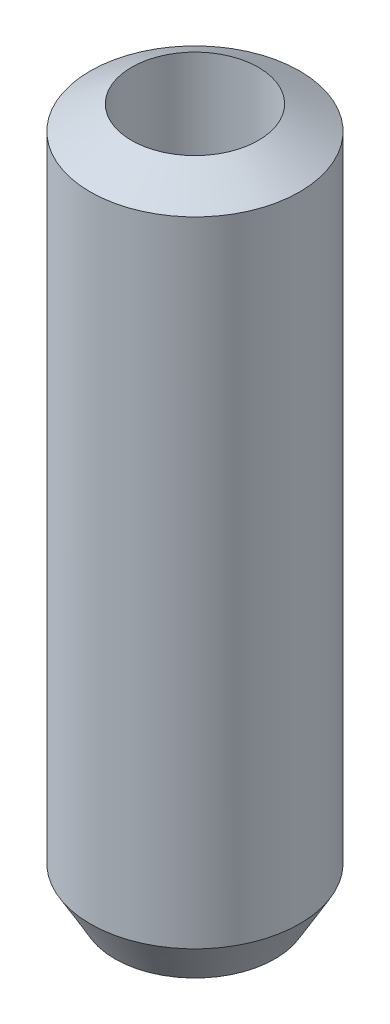
ISO-10303-21;
HEADER;
FILE_DESCRIPTION(('STEP AP214'),'2;1');
FILE_NAME('part.step','',(''),(''),'','','');
FILE_SCHEMA(('AUTOMOTIVE_DESIGN { 1 0 10303 214 1 1 1 1 }'));
ENDSEC;
DATA;
#1=APPLICATION_CONTEXT('core data for automotive mechanical design processes');
#2=APPLICATION_PROTOCOL_DEFINITION('international standard','automotive_design',2000,#1);
#3=PRODUCT_CONTEXT('',#1,'mechanical');
#4=PRODUCT('Part','Part','',(#3));
#5=PRODUCT_RELATED_PRODUCT_CATEGORY('part','',(#4));
#6=PRODUCT_DEFINITION_FORMATION('','',#4);
#7=PRODUCT_DEFINITION_CONTEXT('part definition',#1,'design');
#8=PRODUCT_DEFINITION('design','',#6,#7);
#9=PRODUCT_DEFINITION_SHAPE('','',#8);
#10=(LENGTH_UNIT() NAMED_UNIT(*) SI_UNIT(.MILLI.,.METRE.));
#11=(NAMED_UNIT(*) PLANE_ANGLE_UNIT() SI_UNIT($,.RADIAN.));
#12=(NAMED_UNIT(*) SI_UNIT($,.STERADIAN.) SOLID_ANGLE_UNIT());
#13=UNCERTAINTY_MEASURE_WITH_UNIT(LENGTH_MEASURE(1.E-05),#10,'distance_accuracy_value','');
#14=(GEOMETRIC_REPRESENTATION_CONTEXT(3) GLOBAL_UNCERTAINTY_ASSIGNED_CONTEXT((#13)) GLOBAL_UNIT_ASSIGNED_CONTEXT((#10,
#11,#12)) REPRESENTATION_CONTEXT('',''));
#15=CARTESIAN_POINT('',(0.,0.,0.));
#16=DIRECTION('',(0.,0.,1.));
#17=DIRECTION('',(1.,0.,0.));
#18=AXIS2_PLACEMENT_3D('',#15,#16,#17);
#19=CARTESIAN_POINT('',(0.,167.350945841234,0.));
#20=DIRECTION('',(0.,-1.,0.));
#21=DIRECTION('',(0.,0.,-1.));
#22=AXIS2_PLACEMENT_3D('',#19,#20,#21);
#23=CYLINDRICAL_SURFACE('',#22,25.);
#24=CARTESIAN_POINT('',(0.,161.472744934096,0.));
#25=DIRECTION('',(0.,1.,0.));
#26=DIRECTION('',(0.,0.,1.));
#27=AXIS2_PLACEMENT_3D('',#24,#25,#26);
#28=CIRCLE('',#27,25.);
#29=CARTESIAN_POINT('',(0.,161.472744934096,25.));
#30=VERTEX_POINT('',#29);
#31=EDGE_CURVE('E50',#30,#30,#28,.F.);
#32=ORIENTED_EDGE('',*,*,#31,.T.);
#33=EDGE_LOOP('',(#32));
#34=FACE_BOUND('',#33,.T.);
#35=CARTESIAN_POINT('',(0.,10.1813426282592,0.));
#36=DIRECTION('',(0.,1.,0.));
#37=DIRECTION('',(0.,0.,1.));
#38=AXIS2_PLACEMENT_3D('',#35,#36,#37);
#39=CIRCLE('',#38,25.);
#40=CARTESIAN_POINT('',(0.,10.1813426282592,25.));
#41=VERTEX_POINT('',#40);
#42=EDGE_CURVE('E51',#41,#41,#39,.T.);
#43=ORIENTED_EDGE('',*,*,#42,.T.);
#44=EDGE_LOOP('',(#43));
#45=FACE_BOUND('',#44,.T.);
#46=ADVANCED_FACE('F39',(#34,#45),#23,.T.);
#47=CARTESIAN_POINT('',(0.,0.,0.));
#48=DIRECTION('',(0.,1.,0.));
#49=DIRECTION('',(0.,0.,1.));
#50=AXIS2_PLACEMENT_3D('',#47,#48,#49);
#51=PLANE('',#50);
#52=CARTESIAN_POINT('',(0.,0.,0.));
#53=DIRECTION('',(0.,1.,0.));
#54=DIRECTION('',(0.,0.,1.));
#55=AXIS2_PLACEMENT_3D('',#52,#53,#54);
#56=CIRCLE('',#55,19.1217990928627);
#57=CARTESIAN_POINT('',(0.,0.,19.1217990928627));
#58=VERTEX_POINT('',#57);
#59=EDGE_CURVE('E10',#58,#58,#56,.F.);
#60=ORIENTED_EDGE('',*,*,#59,.T.);
#61=EDGE_LOOP('',(#60));
#62=FACE_BOUND('',#61,.T.);
#63=CARTESIAN_POINT('',(0.,0.,0.));
#64=DIRECTION('',(0.,1.,0.));
#65=DIRECTION('',(0.,0.,1.));
#66=AXIS2_PLACEMENT_3D('',#63,#64,#65);
#67=CIRCLE('',#66,15.1366360652075);
#68=CARTESIAN_POINT('',(0.,0.,15.1366360652075));
#69=VERTEX_POINT('',#68);
#70=EDGE_CURVE('E58',#69,#69,#67,.T.);
#71=ORIENTED_EDGE('',*,*,#70,.T.);
#72=EDGE_LOOP('',(#71));
#73=FACE_BOUND('',#72,.T.);
#74=ADVANCED_FACE('F62',(#62,#73),#51,.F.);
#75=CARTESIAN_POINT('',(0.,167.350945841234,0.));
#76=DIRECTION('',(0.,-1.,0.));
#77=DIRECTION('',(0.,0.,-1.));
#78=AXIS2_PLACEMENT_3D('',#75,#76,#77);
#79=CYLINDRICAL_SURFACE('',#78,15.1366360652075);
#80=CARTESIAN_POINT('',(0.,167.167360756964,0.));
#81=DIRECTION('',(0.,-1.,0.));
#82=DIRECTION('',(0.,0.,-1.));
#83=AXIS2_PLACEMENT_3D('',#80,#81,#82);
#84=CIRCLE('',#83,15.1366360652075);
#85=CARTESIAN_POINT('',(0.,167.167360756964,-15.1366360652075));
#86=VERTEX_POINT('',#85);
#87=EDGE_CURVE('E54',#86,#86,#84,.F.);
#88=ORIENTED_EDGE('',*,*,#87,.T.);
#89=EDGE_LOOP('',(#88));
#90=FACE_BOUND('',#89,.T.);
#91=ORIENTED_EDGE('',*,*,#70,.F.);
#92=EDGE_LOOP('',(#91));
#93=FACE_BOUND('',#92,.T.);
#94=ADVANCED_FACE('F68',(#90,#93),#79,.F.);
#95=CARTESIAN_POINT('',(0.,167.350945841234,0.));
#96=DIRECTION('',(0.,-1.,0.));
#97=DIRECTION('',(0.,0.,-1.));
#98=AXIS2_PLACEMENT_3D('',#95,#96,#97);
#99=CONICAL_SURFACE('',#98,14.8186573717405,1.0471975511966);
#100=ORIENTED_EDGE('',*,*,#31,.F.);
#101=EDGE_LOOP('',(#100));
#102=FACE_BOUND('',#101,.T.);
#103=ORIENTED_EDGE('',*,*,#87,.F.);
#104=EDGE_LOOP('',(#103));
#105=FACE_BOUND('',#104,.T.);
#106=ADVANCED_FACE('F66',(#102,#105),#99,.T.);
#107=CARTESIAN_POINT('',(0.,10.1813426282592,0.));
#108=DIRECTION('',(0.,1.,0.));
#109=DIRECTION('',(0.,0.,1.));
#110=AXIS2_PLACEMENT_3D('',#107,#108,#109);
#111=CONICAL_SURFACE('',#110,25.,0.523598775598303);
#112=ORIENTED_EDGE('',*,*,#59,.F.);
#113=EDGE_LOOP('',(#112));
#114=FACE_BOUND('',#113,.T.);
#115=ORIENTED_EDGE('',*,*,#42,.F.);
#116=EDGE_LOOP('',(#115));
#117=FACE_BOUND('',#116,.T.);
#118=ADVANCED_FACE('F45',(#114,#117),#111,.T.);
#119=CLOSED_SHELL('',(#46,#74,#94,#106,#118));
#120=MANIFOLD_SOLID_BREP('B2',#119);
#121=ADVANCED_BREP_SHAPE_REPRESENTATION('',(#18,#120),#14);
#122=SHAPE_DEFINITION_REPRESENTATION(#9,#121);
ENDSEC;
END-ISO-10303-21;
